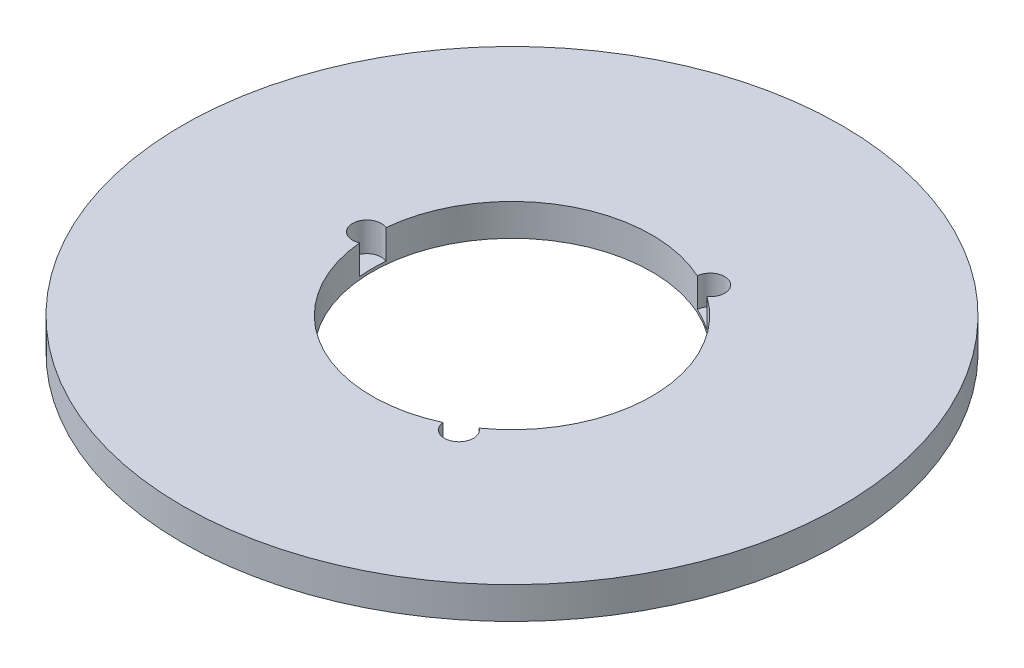
ISO-10303-21;
HEADER;
FILE_DESCRIPTION(('STEP AP214'),'2;1');
FILE_NAME('part.step','',(''),(''),'','','');
FILE_SCHEMA(('AUTOMOTIVE_DESIGN { 1 0 10303 214 1 1 1 1 }'));
ENDSEC;
DATA;
#1=APPLICATION_CONTEXT('core data for automotive mechanical design processes');
#2=APPLICATION_PROTOCOL_DEFINITION('international standard','automotive_design',2000,#1);
#3=PRODUCT_CONTEXT('',#1,'mechanical');
#4=PRODUCT('Part','Part','',(#3));
#5=PRODUCT_RELATED_PRODUCT_CATEGORY('part','',(#4));
#6=PRODUCT_DEFINITION_FORMATION('','',#4);
#7=PRODUCT_DEFINITION_CONTEXT('part definition',#1,'design');
#8=PRODUCT_DEFINITION('design','',#6,#7);
#9=PRODUCT_DEFINITION_SHAPE('','',#8);
#10=(LENGTH_UNIT() NAMED_UNIT(*) SI_UNIT(.MILLI.,.METRE.));
#11=(NAMED_UNIT(*) PLANE_ANGLE_UNIT() SI_UNIT($,.RADIAN.));
#12=(NAMED_UNIT(*) SI_UNIT($,.STERADIAN.) SOLID_ANGLE_UNIT());
#13=UNCERTAINTY_MEASURE_WITH_UNIT(LENGTH_MEASURE(1.E-05),#10,'distance_accuracy_value','');
#14=(GEOMETRIC_REPRESENTATION_CONTEXT(3) GLOBAL_UNCERTAINTY_ASSIGNED_CONTEXT((#13)) GLOBAL_UNIT_ASSIGNED_CONTEXT((#10,
#11,#12)) REPRESENTATION_CONTEXT('',''));
#15=CARTESIAN_POINT('',(0.,0.,0.));
#16=DIRECTION('',(0.,0.,1.));
#17=DIRECTION('',(1.,0.,0.));
#18=AXIS2_PLACEMENT_3D('',#15,#16,#17);
#19=CARTESIAN_POINT('',(0.,8.,0.));
#20=DIRECTION('',(0.,-1.,0.));
#21=DIRECTION('',(0.,0.,-1.));
#22=AXIS2_PLACEMENT_3D('',#19,#20,#21);
#23=CYLINDRICAL_SURFACE('',#22,82.5);
#24=CARTESIAN_POINT('',(0.,8.,0.));
#25=DIRECTION('',(0.,1.,0.));
#26=DIRECTION('',(0.,0.,1.));
#27=AXIS2_PLACEMENT_3D('',#24,#25,#26);
#28=CIRCLE('',#27,82.5);
#29=CARTESIAN_POINT('',(0.,8.,82.5));
#30=VERTEX_POINT('',#29);
#31=EDGE_CURVE('E126',#30,#30,#28,.T.);
#32=ORIENTED_EDGE('',*,*,#31,.F.);
#33=EDGE_LOOP('',(#32));
#34=FACE_BOUND('',#33,.T.);
#35=CARTESIAN_POINT('',(0.,0.,0.));
#36=DIRECTION('',(0.,1.,0.));
#37=DIRECTION('',(0.,0.,1.));
#38=AXIS2_PLACEMENT_3D('',#35,#36,#37);
#39=CIRCLE('',#38,82.5);
#40=CARTESIAN_POINT('',(0.,0.,82.5));
#41=VERTEX_POINT('',#40);
#42=EDGE_CURVE('E124',#41,#41,#39,.T.);
#43=ORIENTED_EDGE('',*,*,#42,.T.);
#44=EDGE_LOOP('',(#43));
#45=FACE_BOUND('',#44,.T.);
#46=ADVANCED_FACE('F39',(#34,#45),#23,.T.);
#47=CARTESIAN_POINT('',(0.,8.,0.));
#48=DIRECTION('',(0.,1.,0.));
#49=DIRECTION('',(0.,0.,1.));
#50=AXIS2_PLACEMENT_3D('',#47,#48,#49);
#51=PLANE('',#50);
#52=CARTESIAN_POINT('',(18.1598242300367,8.,31.4537382229436));
#53=DIRECTION('',(0.,1.,0.));
#54=DIRECTION('',(0.866025403784436,0.,-0.500000000000004));
#55=AXIS2_PLACEMENT_3D('',#52,#53,#54);
#56=CIRCLE('',#55,3.62174295056489);
#57=CARTESIAN_POINT('',(14.5575620014917,8.,31.8288766464153));
#58=VERTEX_POINT('',#57);
#59=CARTESIAN_POINT('',(20.2858347489713,8.,28.5216568336664));
#60=VERTEX_POINT('',#59);
#61=EDGE_CURVE('E147',#58,#60,#56,.T.);
#62=ORIENTED_EDGE('',*,*,#61,.F.);
#63=CARTESIAN_POINT('',(0.,8.,0.));
#64=DIRECTION('',(0.,1.,0.));
#65=DIRECTION('',(0.,0.,1.));
#66=AXIS2_PLACEMENT_3D('',#63,#64,#65);
#67=CIRCLE('',#66,35.);
#68=CARTESIAN_POINT('',(-34.8433967504628,8.,3.30721981274895));
#69=VERTEX_POINT('',#68);
#70=EDGE_CURVE('E118',#69,#58,#67,.T.);
#71=ORIENTED_EDGE('',*,*,#70,.F.);
#72=CARTESIAN_POINT('',(-36.3196484600731,8.,0.));
#73=DIRECTION('',(0.,1.,0.));
#74=DIRECTION('',(0.,0.,1.));
#75=AXIS2_PLACEMENT_3D('',#72,#73,#74);
#76=CIRCLE('',#75,3.62174295056489);
#77=CARTESIAN_POINT('',(-34.8433967504628,8.,-3.30721981274895));
#78=VERTEX_POINT('',#77);
#79=EDGE_CURVE('E113',#78,#69,#76,.T.);
#80=ORIENTED_EDGE('',*,*,#79,.F.);
#81=CARTESIAN_POINT('',(14.5575620014913,8.,-31.8288766464156));
#82=VERTEX_POINT('',#81);
#83=EDGE_CURVE('E106',#82,#78,#67,.T.);
#84=ORIENTED_EDGE('',*,*,#83,.F.);
#85=CARTESIAN_POINT('',(18.1598242300362,8.,-31.4537382229438));
#86=DIRECTION('',(0.,1.,0.));
#87=DIRECTION('',(-0.866025403784443,0.,-0.499999999999992));
#88=AXIS2_PLACEMENT_3D('',#85,#86,#87);
#89=CIRCLE('',#88,3.62174295056489);
#90=CARTESIAN_POINT('',(20.2858347489709,8.,-28.5216568336667));
#91=VERTEX_POINT('',#90);
#92=EDGE_CURVE('E90',#91,#82,#89,.T.);
#93=ORIENTED_EDGE('',*,*,#92,.F.);
#94=EDGE_CURVE('E116',#60,#91,#67,.T.);
#95=ORIENTED_EDGE('',*,*,#94,.F.);
#96=EDGE_LOOP('',(#62,#71,#80,#84,#93,#95));
#97=FACE_BOUND('',#96,.T.);
#98=ORIENTED_EDGE('',*,*,#31,.T.);
#99=EDGE_LOOP('',(#98));
#100=FACE_BOUND('',#99,.T.);
#101=ADVANCED_FACE('F115',(#97,#100),#51,.T.);
#102=CARTESIAN_POINT('',(0.,0.,0.));
#103=DIRECTION('',(0.,1.,0.));
#104=DIRECTION('',(0.,0.,1.));
#105=AXIS2_PLACEMENT_3D('',#102,#103,#104);
#106=PLANE('',#105);
#107=CARTESIAN_POINT('',(0.,0.,0.));
#108=DIRECTION('',(0.,1.,0.));
#109=DIRECTION('',(0.,0.,1.));
#110=AXIS2_PLACEMENT_3D('',#107,#108,#109);
#111=CIRCLE('',#110,35.);
#112=CARTESIAN_POINT('',(0.,0.,35.));
#113=VERTEX_POINT('',#112);
#114=EDGE_CURVE('E120',#113,#113,#111,.T.);
#115=ORIENTED_EDGE('',*,*,#114,.T.);
#116=EDGE_LOOP('',(#115));
#117=FACE_BOUND('',#116,.T.);
#118=ORIENTED_EDGE('',*,*,#42,.F.);
#119=EDGE_LOOP('',(#118));
#120=FACE_BOUND('',#119,.T.);
#121=ADVANCED_FACE('F164',(#117,#120),#106,.F.);
#122=CARTESIAN_POINT('',(0.,8.,0.));
#123=DIRECTION('',(0.,-1.,0.));
#124=DIRECTION('',(0.,0.,-1.));
#125=AXIS2_PLACEMENT_3D('',#122,#123,#124);
#126=CYLINDRICAL_SURFACE('',#125,35.);
#127=DIRECTION('',(0.,1.,0.));
#128=VECTOR('',#127,1.);
#129=CARTESIAN_POINT('',(14.5575620014917,4.34918054708102,31.8288766464153));
#130=LINE('',#129,#128);
#131=CARTESIAN_POINT('',(14.5575620014917,0.69836109416203,31.8288766464153));
#132=VERTEX_POINT('',#131);
#133=EDGE_CURVE('E11',#132,#58,#130,.T.);
#134=ORIENTED_EDGE('',*,*,#133,.F.);
#135=CARTESIAN_POINT('',(0.,0.69836109416203,0.));
#136=DIRECTION('',(0.,1.,0.));
#137=DIRECTION('',(0.,0.,1.));
#138=AXIS2_PLACEMENT_3D('',#135,#136,#137);
#139=CIRCLE('',#138,35.);
#140=CARTESIAN_POINT('',(20.2858347489713,0.69836109416203,28.5216568336664));
#141=VERTEX_POINT('',#140);
#142=EDGE_CURVE('E144',#132,#141,#139,.T.);
#143=ORIENTED_EDGE('',*,*,#142,.T.);
#144=DIRECTION('',(0.,1.,0.));
#145=VECTOR('',#144,1.);
#146=CARTESIAN_POINT('',(20.2858347489713,4.34918054708102,28.5216568336664));
#147=LINE('',#146,#145);
#148=EDGE_CURVE('E46',#60,#141,#147,.F.);
#149=ORIENTED_EDGE('',*,*,#148,.F.);
#150=ORIENTED_EDGE('',*,*,#94,.T.);
#151=DIRECTION('',(0.,1.,0.));
#152=VECTOR('',#151,1.);
#153=CARTESIAN_POINT('',(20.2858347489709,4.34918054708102,-28.5216568336666));
#154=LINE('',#153,#152);
#155=CARTESIAN_POINT('',(20.2858347489709,0.69836109416203,-28.5216568336667));
#156=VERTEX_POINT('',#155);
#157=EDGE_CURVE('E92',#156,#91,#154,.T.);
#158=ORIENTED_EDGE('',*,*,#157,.F.);
#159=CARTESIAN_POINT('',(0.,0.69836109416203,0.));
#160=DIRECTION('',(0.,1.,0.));
#161=DIRECTION('',(0.,0.,1.));
#162=AXIS2_PLACEMENT_3D('',#159,#160,#161);
#163=CIRCLE('',#162,35.);
#164=CARTESIAN_POINT('',(14.5575620014913,0.69836109416203,-31.8288766464156));
#165=VERTEX_POINT('',#164);
#166=EDGE_CURVE('E107',#156,#165,#163,.T.);
#167=ORIENTED_EDGE('',*,*,#166,.T.);
#168=DIRECTION('',(0.,1.,0.));
#169=VECTOR('',#168,1.);
#170=CARTESIAN_POINT('',(14.5575620014913,4.34918054708102,-31.8288766464155));
#171=LINE('',#170,#169);
#172=EDGE_CURVE('E95',#82,#165,#171,.F.);
#173=ORIENTED_EDGE('',*,*,#172,.F.);
#174=ORIENTED_EDGE('',*,*,#83,.T.);
#175=DIRECTION('',(0.,1.,0.));
#176=VECTOR('',#175,1.);
#177=CARTESIAN_POINT('',(-34.8433967504628,4.34918054708102,-3.30721981274895));
#178=LINE('',#177,#176);
#179=CARTESIAN_POINT('',(-34.8433967504628,0.69836109416203,-3.30721981274895));
#180=VERTEX_POINT('',#179);
#181=EDGE_CURVE('E143',#180,#78,#178,.T.);
#182=ORIENTED_EDGE('',*,*,#181,.F.);
#183=CARTESIAN_POINT('',(0.,0.69836109416203,0.));
#184=DIRECTION('',(0.,1.,0.));
#185=DIRECTION('',(0.,0.,1.));
#186=AXIS2_PLACEMENT_3D('',#183,#184,#185);
#187=CIRCLE('',#186,35.);
#188=CARTESIAN_POINT('',(-34.8433967504628,0.69836109416203,3.30721981274895));
#189=VERTEX_POINT('',#188);
#190=EDGE_CURVE('E132',#180,#189,#187,.T.);
#191=ORIENTED_EDGE('',*,*,#190,.T.);
#192=DIRECTION('',(0.,1.,0.));
#193=VECTOR('',#192,1.);
#194=CARTESIAN_POINT('',(-34.8433967504628,4.34918054708102,3.30721981274895));
#195=LINE('',#194,#193);
#196=EDGE_CURVE('E137',#69,#189,#195,.F.);
#197=ORIENTED_EDGE('',*,*,#196,.F.);
#198=ORIENTED_EDGE('',*,*,#70,.T.);
#199=EDGE_LOOP('',(#134,#143,#149,#150,#158,#167,#173,#174,#182,#191,#197,#198));
#200=FACE_BOUND('',#199,.T.);
#201=ORIENTED_EDGE('',*,*,#114,.F.);
#202=EDGE_LOOP('',(#201));
#203=FACE_BOUND('',#202,.T.);
#204=ADVANCED_FACE('F103',(#200,#203),#126,.F.);
#205=CARTESIAN_POINT('',(-36.3196484600731,0.69836109416203,0.));
#206=DIRECTION('',(0.,1.,0.));
#207=DIRECTION('',(0.,0.,1.));
#208=AXIS2_PLACEMENT_3D('',#205,#206,#207);
#209=CYLINDRICAL_SURFACE('',#208,3.62174295056489);
#210=ORIENTED_EDGE('',*,*,#181,.T.);
#211=ORIENTED_EDGE('',*,*,#79,.T.);
#212=ORIENTED_EDGE('',*,*,#196,.T.);
#213=CARTESIAN_POINT('',(-36.3196484600731,0.69836109416203,0.));
#214=DIRECTION('',(0.,1.,0.));
#215=DIRECTION('',(0.,0.,1.));
#216=AXIS2_PLACEMENT_3D('',#213,#214,#215);
#217=CIRCLE('',#216,3.62174295056489);
#218=EDGE_CURVE('E121',#180,#189,#217,.T.);
#219=ORIENTED_EDGE('',*,*,#218,.F.);
#220=EDGE_LOOP('',(#210,#211,#212,#219));
#221=FACE_BOUND('',#220,.T.);
#222=ADVANCED_FACE('F174',(#221),#209,.F.);
#223=CARTESIAN_POINT('',(-36.3196484600731,0.69836109416203,0.));
#224=DIRECTION('',(0.,1.,0.));
#225=DIRECTION('',(0.,0.,1.));
#226=AXIS2_PLACEMENT_3D('',#223,#224,#225);
#227=PLANE('',#226);
#228=ORIENTED_EDGE('',*,*,#218,.T.);
#229=ORIENTED_EDGE('',*,*,#190,.F.);
#230=EDGE_LOOP('',(#228,#229));
#231=FACE_BOUND('',#230,.T.);
#232=ADVANCED_FACE('F177',(#231),#227,.T.);
#233=CARTESIAN_POINT('',(18.1598242300362,0.69836109416203,-31.4537382229438));
#234=DIRECTION('',(0.,1.,0.));
#235=DIRECTION('',(0.,0.,1.));
#236=AXIS2_PLACEMENT_3D('',#233,#234,#235);
#237=CYLINDRICAL_SURFACE('',#236,3.62174295056489);
#238=ORIENTED_EDGE('',*,*,#157,.T.);
#239=ORIENTED_EDGE('',*,*,#92,.T.);
#240=ORIENTED_EDGE('',*,*,#172,.T.);
#241=CARTESIAN_POINT('',(18.1598242300362,0.69836109416203,-31.4537382229438));
#242=DIRECTION('',(0.,1.,0.));
#243=DIRECTION('',(-0.866025403784443,0.,-0.499999999999992));
#244=AXIS2_PLACEMENT_3D('',#241,#242,#243);
#245=CIRCLE('',#244,3.62174295056489);
#246=EDGE_CURVE('E56',#156,#165,#245,.T.);
#247=ORIENTED_EDGE('',*,*,#246,.F.);
#248=EDGE_LOOP('',(#238,#239,#240,#247));
#249=FACE_BOUND('',#248,.T.);
#250=ADVANCED_FACE('F93',(#249),#237,.F.);
#251=CARTESIAN_POINT('',(18.1598242300362,0.69836109416203,-31.4537382229438));
#252=DIRECTION('',(0.,1.,0.));
#253=DIRECTION('',(-0.866025403784443,0.,-0.499999999999992));
#254=AXIS2_PLACEMENT_3D('',#251,#252,#253);
#255=PLANE('',#254);
#256=ORIENTED_EDGE('',*,*,#246,.T.);
#257=ORIENTED_EDGE('',*,*,#166,.F.);
#258=EDGE_LOOP('',(#256,#257));
#259=FACE_BOUND('',#258,.T.);
#260=ADVANCED_FACE('F160',(#259),#255,.T.);
#261=CARTESIAN_POINT('',(18.1598242300367,0.69836109416203,31.4537382229436));
#262=DIRECTION('',(0.,1.,0.));
#263=DIRECTION('',(0.,0.,1.));
#264=AXIS2_PLACEMENT_3D('',#261,#262,#263);
#265=CYLINDRICAL_SURFACE('',#264,3.62174295056489);
#266=ORIENTED_EDGE('',*,*,#133,.T.);
#267=ORIENTED_EDGE('',*,*,#61,.T.);
#268=ORIENTED_EDGE('',*,*,#148,.T.);
#269=CARTESIAN_POINT('',(18.1598242300367,0.69836109416203,31.4537382229436));
#270=DIRECTION('',(0.,1.,0.));
#271=DIRECTION('',(0.866025403784436,0.,-0.500000000000004));
#272=AXIS2_PLACEMENT_3D('',#269,#270,#271);
#273=CIRCLE('',#272,3.62174295056489);
#274=EDGE_CURVE('E55',#132,#141,#273,.T.);
#275=ORIENTED_EDGE('',*,*,#274,.F.);
#276=EDGE_LOOP('',(#266,#267,#268,#275));
#277=FACE_BOUND('',#276,.T.);
#278=ADVANCED_FACE('F149',(#277),#265,.F.);
#279=CARTESIAN_POINT('',(18.1598242300367,0.69836109416203,31.4537382229436));
#280=DIRECTION('',(0.,1.,0.));
#281=DIRECTION('',(0.866025403784436,0.,-0.500000000000004));
#282=AXIS2_PLACEMENT_3D('',#279,#280,#281);
#283=PLANE('',#282);
#284=ORIENTED_EDGE('',*,*,#274,.T.);
#285=ORIENTED_EDGE('',*,*,#142,.F.);
#286=EDGE_LOOP('',(#284,#285));
#287=FACE_BOUND('',#286,.T.);
#288=ADVANCED_FACE('F151',(#287),#283,.T.);
#289=CLOSED_SHELL('',(#46,#101,#121,#204,#222,#232,#250,#260,#278,#288));
#290=MANIFOLD_SOLID_BREP('B2',#289);
#291=ADVANCED_BREP_SHAPE_REPRESENTATION('',(#18,#290),#14);
#292=SHAPE_DEFINITION_REPRESENTATION(#9,#291);
ENDSEC;
END-ISO-10303-21;
